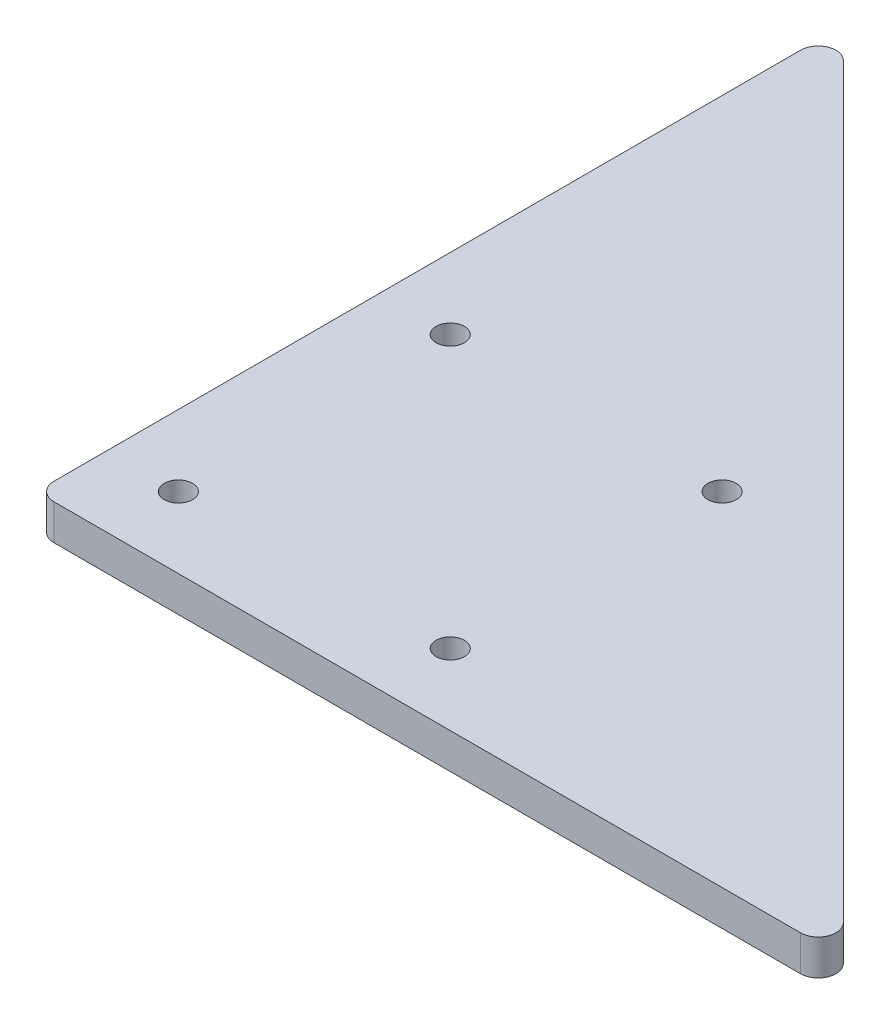
ISO-10303-21;
HEADER;
FILE_DESCRIPTION(('STEP AP214'),'2;1');
FILE_NAME('part.step','',(''),(''),'','','');
FILE_SCHEMA(('AUTOMOTIVE_DESIGN { 1 0 10303 214 1 1 1 1 }'));
ENDSEC;
DATA;
#1=APPLICATION_CONTEXT('core data for automotive mechanical design processes');
#2=APPLICATION_PROTOCOL_DEFINITION('international standard','automotive_design',2000,#1);
#3=PRODUCT_CONTEXT('',#1,'mechanical');
#4=PRODUCT('Part','Part','',(#3));
#5=PRODUCT_RELATED_PRODUCT_CATEGORY('part','',(#4));
#6=PRODUCT_DEFINITION_FORMATION('','',#4);
#7=PRODUCT_DEFINITION_CONTEXT('part definition',#1,'design');
#8=PRODUCT_DEFINITION('design','',#6,#7);
#9=PRODUCT_DEFINITION_SHAPE('','',#8);
#10=(LENGTH_UNIT() NAMED_UNIT(*) SI_UNIT(.MILLI.,.METRE.));
#11=(NAMED_UNIT(*) PLANE_ANGLE_UNIT() SI_UNIT($,.RADIAN.));
#12=(NAMED_UNIT(*) SI_UNIT($,.STERADIAN.) SOLID_ANGLE_UNIT());
#13=UNCERTAINTY_MEASURE_WITH_UNIT(LENGTH_MEASURE(1.E-05),#10,'distance_accuracy_value','');
#14=(GEOMETRIC_REPRESENTATION_CONTEXT(3) GLOBAL_UNCERTAINTY_ASSIGNED_CONTEXT((#13)) GLOBAL_UNIT_ASSIGNED_CONTEXT((#10,
#11,#12)) REPRESENTATION_CONTEXT('',''));
#15=CARTESIAN_POINT('',(0.,0.,0.));
#16=DIRECTION('',(0.,0.,1.));
#17=DIRECTION('',(1.,0.,0.));
#18=AXIS2_PLACEMENT_3D('',#15,#16,#17);
#19=CARTESIAN_POINT('',(94.2218254069472,6.,32.));
#20=DIRECTION('',(0.,-1.,0.));
#21=DIRECTION('',(0.,0.,-1.));
#22=AXIS2_PLACEMENT_3D('',#19,#20,#21);
#23=CYLINDRICAL_SURFACE('',#22,3.);
#24=CARTESIAN_POINT('',(94.2218254069472,0.,32.));
#25=DIRECTION('',(0.,1.,0.));
#26=DIRECTION('',(0.,0.,1.));
#27=AXIS2_PLACEMENT_3D('',#24,#25,#26);
#28=CIRCLE('',#27,3.);
#29=CARTESIAN_POINT('',(94.2218254069471,0.,35.));
#30=VERTEX_POINT('',#29);
#31=CARTESIAN_POINT('',(96.3431457505068,0.,29.8786796564404));
#32=VERTEX_POINT('',#31);
#33=EDGE_CURVE('E145',#30,#32,#28,.T.);
#34=ORIENTED_EDGE('',*,*,#33,.T.);
#35=DIRECTION('',(0.,-1.,0.));
#36=VECTOR('',#35,1.);
#37=CARTESIAN_POINT('',(96.3431457505068,6.,29.8786796564404));
#38=LINE('',#37,#36);
#39=CARTESIAN_POINT('',(96.3431457505068,6.,29.8786796564404));
#40=VERTEX_POINT('',#39);
#41=EDGE_CURVE('E11',#40,#32,#38,.T.);
#42=ORIENTED_EDGE('',*,*,#41,.F.);
#43=CARTESIAN_POINT('',(94.2218254069472,6.,32.));
#44=DIRECTION('',(0.,1.,0.));
#45=DIRECTION('',(0.,0.,1.));
#46=AXIS2_PLACEMENT_3D('',#43,#44,#45);
#47=CIRCLE('',#46,3.);
#48=CARTESIAN_POINT('',(94.2218254069471,6.,35.));
#49=VERTEX_POINT('',#48);
#50=EDGE_CURVE('E176',#49,#40,#47,.T.);
#51=ORIENTED_EDGE('',*,*,#50,.F.);
#52=DIRECTION('',(0.,-1.,0.));
#53=VECTOR('',#52,1.);
#54=CARTESIAN_POINT('',(94.2218254069471,6.,35.));
#55=LINE('',#54,#53);
#56=EDGE_CURVE('E144',#49,#30,#55,.T.);
#57=ORIENTED_EDGE('',*,*,#56,.T.);
#58=EDGE_LOOP('',(#34,#42,#51,#57));
#59=FACE_BOUND('',#58,.T.);
#60=ADVANCED_FACE('F38',(#59),#23,.T.);
#61=CARTESIAN_POINT('',(33.2322330470339,6.,-33.2322330470334));
#62=DIRECTION('',(-0.707106781186552,0.,0.707106781186543));
#63=DIRECTION('',(0.707106781186543,0.,0.707106781186552));
#64=AXIS2_PLACEMENT_3D('',#61,#62,#63);
#65=PLANE('',#64);
#66=DIRECTION('',(-0.707106781186543,0.,-0.707106781186552));
#67=VECTOR('',#66,1.);
#68=CARTESIAN_POINT('',(33.2322330470339,0.,-33.2322330470334));
#69=LINE('',#68,#67);
#70=CARTESIAN_POINT('',(-29.8786796564402,0.,-96.3431457505084));
#71=VERTEX_POINT('',#70);
#72=EDGE_CURVE('E149',#32,#71,#69,.T.);
#73=ORIENTED_EDGE('',*,*,#72,.T.);
#74=DIRECTION('',(0.,-1.,0.));
#75=VECTOR('',#74,1.);
#76=CARTESIAN_POINT('',(-29.8786796564402,6.,-96.3431457505084));
#77=LINE('',#76,#75);
#78=CARTESIAN_POINT('',(-29.8786796564402,6.,-96.3431457505084));
#79=VERTEX_POINT('',#78);
#80=EDGE_CURVE('E47',#79,#71,#77,.T.);
#81=ORIENTED_EDGE('',*,*,#80,.F.);
#82=DIRECTION('',(-0.707106781186543,0.,-0.707106781186552));
#83=VECTOR('',#82,1.);
#84=CARTESIAN_POINT('',(33.2322330470339,6.,-33.2322330470334));
#85=LINE('',#84,#83);
#86=EDGE_CURVE('E92',#40,#79,#85,.T.);
#87=ORIENTED_EDGE('',*,*,#86,.F.);
#88=ORIENTED_EDGE('',*,*,#41,.T.);
#89=EDGE_LOOP('',(#73,#81,#87,#88));
#90=FACE_BOUND('',#89,.T.);
#91=ADVANCED_FACE('F210',(#90),#65,.F.);
#92=CARTESIAN_POINT('',(-31.9999999999999,6.,-94.2218254069488));
#93=DIRECTION('',(0.,-1.,0.));
#94=DIRECTION('',(0.,0.,-1.));
#95=AXIS2_PLACEMENT_3D('',#92,#93,#94);
#96=CYLINDRICAL_SURFACE('',#95,3.00000000000001);
#97=CARTESIAN_POINT('',(-31.9999999999999,0.,-94.2218254069488));
#98=DIRECTION('',(0.,1.,0.));
#99=DIRECTION('',(0.,0.,1.));
#100=AXIS2_PLACEMENT_3D('',#97,#98,#99);
#101=CIRCLE('',#100,3.00000000000001);
#102=CARTESIAN_POINT('',(-34.9999999999999,0.,-94.2218254069488));
#103=VERTEX_POINT('',#102);
#104=EDGE_CURVE('E152',#71,#103,#101,.T.);
#105=ORIENTED_EDGE('',*,*,#104,.T.);
#106=DIRECTION('',(0.,-1.,0.));
#107=VECTOR('',#106,1.);
#108=CARTESIAN_POINT('',(-34.9999999999999,6.,-94.2218254069488));
#109=LINE('',#108,#107);
#110=CARTESIAN_POINT('',(-34.9999999999999,6.,-94.2218254069488));
#111=VERTEX_POINT('',#110);
#112=EDGE_CURVE('E117',#111,#103,#109,.T.);
#113=ORIENTED_EDGE('',*,*,#112,.F.);
#114=CARTESIAN_POINT('',(-31.9999999999999,6.,-94.2218254069488));
#115=DIRECTION('',(0.,1.,0.));
#116=DIRECTION('',(0.,0.,1.));
#117=AXIS2_PLACEMENT_3D('',#114,#115,#116);
#118=CIRCLE('',#117,3.00000000000001);
#119=EDGE_CURVE('E106',#79,#111,#118,.T.);
#120=ORIENTED_EDGE('',*,*,#119,.F.);
#121=ORIENTED_EDGE('',*,*,#80,.T.);
#122=EDGE_LOOP('',(#105,#113,#120,#121));
#123=FACE_BOUND('',#122,.T.);
#124=ADVANCED_FACE('F186',(#123),#96,.T.);
#125=CARTESIAN_POINT('',(-35.,6.,0.));
#126=DIRECTION('',(1.,0.,0.));
#127=DIRECTION('',(0.,0.,-1.));
#128=AXIS2_PLACEMENT_3D('',#125,#126,#127);
#129=PLANE('',#128);
#130=DIRECTION('',(0.,0.,1.));
#131=VECTOR('',#130,1.);
#132=CARTESIAN_POINT('',(-35.,0.,0.));
#133=LINE('',#132,#131);
#134=CARTESIAN_POINT('',(-35.,0.,32.));
#135=VERTEX_POINT('',#134);
#136=EDGE_CURVE('E115',#103,#135,#133,.T.);
#137=ORIENTED_EDGE('',*,*,#136,.T.);
#138=DIRECTION('',(0.,-1.,0.));
#139=VECTOR('',#138,1.);
#140=CARTESIAN_POINT('',(-35.,6.,32.));
#141=LINE('',#140,#139);
#142=CARTESIAN_POINT('',(-35.,6.,32.));
#143=VERTEX_POINT('',#142);
#144=EDGE_CURVE('E112',#143,#135,#141,.T.);
#145=ORIENTED_EDGE('',*,*,#144,.F.);
#146=DIRECTION('',(0.,0.,1.));
#147=VECTOR('',#146,1.);
#148=CARTESIAN_POINT('',(-35.,6.,0.));
#149=LINE('',#148,#147);
#150=EDGE_CURVE('E99',#111,#143,#149,.T.);
#151=ORIENTED_EDGE('',*,*,#150,.F.);
#152=ORIENTED_EDGE('',*,*,#112,.T.);
#153=EDGE_LOOP('',(#137,#145,#151,#152));
#154=FACE_BOUND('',#153,.T.);
#155=ADVANCED_FACE('F113',(#154),#129,.F.);
#156=CARTESIAN_POINT('',(-32.,6.,32.));
#157=DIRECTION('',(0.,-1.,0.));
#158=DIRECTION('',(0.,0.,-1.));
#159=AXIS2_PLACEMENT_3D('',#156,#157,#158);
#160=CYLINDRICAL_SURFACE('',#159,3.00000000000001);
#161=CARTESIAN_POINT('',(-32.,0.,32.));
#162=DIRECTION('',(0.,1.,0.));
#163=DIRECTION('',(0.,0.,1.));
#164=AXIS2_PLACEMENT_3D('',#161,#162,#163);
#165=CIRCLE('',#164,3.00000000000001);
#166=CARTESIAN_POINT('',(-32.,0.,35.));
#167=VERTEX_POINT('',#166);
#168=EDGE_CURVE('E78',#135,#167,#165,.T.);
#169=ORIENTED_EDGE('',*,*,#168,.T.);
#170=DIRECTION('',(0.,-1.,0.));
#171=VECTOR('',#170,1.);
#172=CARTESIAN_POINT('',(-32.,6.,35.));
#173=LINE('',#172,#171);
#174=CARTESIAN_POINT('',(-32.,6.,35.));
#175=VERTEX_POINT('',#174);
#176=EDGE_CURVE('E118',#175,#167,#173,.T.);
#177=ORIENTED_EDGE('',*,*,#176,.F.);
#178=CARTESIAN_POINT('',(-32.,6.,32.));
#179=DIRECTION('',(0.,1.,0.));
#180=DIRECTION('',(0.,0.,1.));
#181=AXIS2_PLACEMENT_3D('',#178,#179,#180);
#182=CIRCLE('',#181,3.00000000000001);
#183=EDGE_CURVE('E104',#143,#175,#182,.T.);
#184=ORIENTED_EDGE('',*,*,#183,.F.);
#185=ORIENTED_EDGE('',*,*,#144,.T.);
#186=EDGE_LOOP('',(#169,#177,#184,#185));
#187=FACE_BOUND('',#186,.T.);
#188=ADVANCED_FACE('F120',(#187),#160,.T.);
#189=CARTESIAN_POINT('',(22.9809703885639,6.,22.9809703885617));
#190=DIRECTION('',(0.,-1.,0.));
#191=DIRECTION('',(0.,0.,-1.));
#192=AXIS2_PLACEMENT_3D('',#189,#190,#191);
#193=CYLINDRICAL_SURFACE('',#192,2.4);
#194=CARTESIAN_POINT('',(22.9809703885639,6.,22.9809703885617));
#195=DIRECTION('',(0.,1.,0.));
#196=DIRECTION('',(0.,0.,1.));
#197=AXIS2_PLACEMENT_3D('',#194,#195,#196);
#198=CIRCLE('',#197,2.4);
#199=CARTESIAN_POINT('',(22.9809703885639,6.,25.3809703885617));
#200=VERTEX_POINT('',#199);
#201=EDGE_CURVE('E136',#200,#200,#198,.T.);
#202=ORIENTED_EDGE('',*,*,#201,.T.);
#203=EDGE_LOOP('',(#202));
#204=FACE_BOUND('',#203,.T.);
#205=CARTESIAN_POINT('',(22.9809703885639,0.,22.9809703885617));
#206=DIRECTION('',(0.,1.,0.));
#207=DIRECTION('',(0.,0.,1.));
#208=AXIS2_PLACEMENT_3D('',#205,#206,#207);
#209=CIRCLE('',#208,2.4);
#210=CARTESIAN_POINT('',(22.9809703885639,0.,25.3809703885617));
#211=VERTEX_POINT('',#210);
#212=EDGE_CURVE('E168',#211,#211,#209,.T.);
#213=ORIENTED_EDGE('',*,*,#212,.F.);
#214=EDGE_LOOP('',(#213));
#215=FACE_BOUND('',#214,.T.);
#216=ADVANCED_FACE('F221',(#204,#215),#193,.F.);
#217=CARTESIAN_POINT('',(22.9809703885628,6.,-22.9809703885639));
#218=DIRECTION('',(0.,-1.,0.));
#219=DIRECTION('',(0.,0.,-1.));
#220=AXIS2_PLACEMENT_3D('',#217,#218,#219);
#221=CYLINDRICAL_SURFACE('',#220,2.4);
#222=CARTESIAN_POINT('',(22.9809703885628,6.,-22.9809703885639));
#223=DIRECTION('',(0.,1.,0.));
#224=DIRECTION('',(0.,0.,1.));
#225=AXIS2_PLACEMENT_3D('',#222,#223,#224);
#226=CIRCLE('',#225,2.4);
#227=CARTESIAN_POINT('',(22.9809703885628,6.,-20.5809703885639));
#228=VERTEX_POINT('',#227);
#229=EDGE_CURVE('E132',#228,#228,#226,.T.);
#230=ORIENTED_EDGE('',*,*,#229,.T.);
#231=EDGE_LOOP('',(#230));
#232=FACE_BOUND('',#231,.T.);
#233=CARTESIAN_POINT('',(22.9809703885628,0.,-22.9809703885639));
#234=DIRECTION('',(0.,1.,0.));
#235=DIRECTION('',(0.,0.,1.));
#236=AXIS2_PLACEMENT_3D('',#233,#234,#235);
#237=CIRCLE('',#236,2.4);
#238=CARTESIAN_POINT('',(22.9809703885628,0.,-20.5809703885639));
#239=VERTEX_POINT('',#238);
#240=EDGE_CURVE('E164',#239,#239,#237,.T.);
#241=ORIENTED_EDGE('',*,*,#240,.F.);
#242=EDGE_LOOP('',(#241));
#243=FACE_BOUND('',#242,.T.);
#244=ADVANCED_FACE('F205',(#232,#243),#221,.F.);
#245=CARTESIAN_POINT('',(-22.9809703885628,6.,-22.9809703885628));
#246=DIRECTION('',(0.,-1.,0.));
#247=DIRECTION('',(0.,0.,-1.));
#248=AXIS2_PLACEMENT_3D('',#245,#246,#247);
#249=CYLINDRICAL_SURFACE('',#248,2.4);
#250=CARTESIAN_POINT('',(-22.9809703885628,6.,-22.9809703885628));
#251=DIRECTION('',(0.,1.,0.));
#252=DIRECTION('',(0.,0.,1.));
#253=AXIS2_PLACEMENT_3D('',#250,#251,#252);
#254=CIRCLE('',#253,2.4);
#255=CARTESIAN_POINT('',(-22.9809703885628,6.,-20.5809703885628));
#256=VERTEX_POINT('',#255);
#257=EDGE_CURVE('E126',#256,#256,#254,.T.);
#258=ORIENTED_EDGE('',*,*,#257,.T.);
#259=EDGE_LOOP('',(#258));
#260=FACE_BOUND('',#259,.T.);
#261=CARTESIAN_POINT('',(-22.9809703885628,0.,-22.9809703885628));
#262=DIRECTION('',(0.,1.,0.));
#263=DIRECTION('',(0.,0.,1.));
#264=AXIS2_PLACEMENT_3D('',#261,#262,#263);
#265=CIRCLE('',#264,2.4);
#266=CARTESIAN_POINT('',(-22.9809703885628,0.,-20.5809703885628));
#267=VERTEX_POINT('',#266);
#268=EDGE_CURVE('E160',#267,#267,#265,.T.);
#269=ORIENTED_EDGE('',*,*,#268,.F.);
#270=EDGE_LOOP('',(#269));
#271=FACE_BOUND('',#270,.T.);
#272=ADVANCED_FACE('F197',(#260,#271),#249,.F.);
#273=CARTESIAN_POINT('',(0.,6.,35.));
#274=DIRECTION('',(0.,0.,-1.));
#275=DIRECTION('',(-1.,0.,0.));
#276=AXIS2_PLACEMENT_3D('',#273,#274,#275);
#277=PLANE('',#276);
#278=DIRECTION('',(1.,0.,0.));
#279=VECTOR('',#278,1.);
#280=CARTESIAN_POINT('',(0.,0.,35.));
#281=LINE('',#280,#279);
#282=EDGE_CURVE('E84',#167,#30,#281,.T.);
#283=ORIENTED_EDGE('',*,*,#282,.T.);
#284=ORIENTED_EDGE('',*,*,#56,.F.);
#285=DIRECTION('',(1.,0.,0.));
#286=VECTOR('',#285,1.);
#287=CARTESIAN_POINT('',(0.,6.,35.));
#288=LINE('',#287,#286);
#289=EDGE_CURVE('E55',#175,#49,#288,.T.);
#290=ORIENTED_EDGE('',*,*,#289,.F.);
#291=ORIENTED_EDGE('',*,*,#176,.T.);
#292=EDGE_LOOP('',(#283,#284,#290,#291));
#293=FACE_BOUND('',#292,.T.);
#294=ADVANCED_FACE('F194',(#293),#277,.F.);
#295=CARTESIAN_POINT('',(-22.9809703885617,6.,22.9809703885628));
#296=DIRECTION('',(0.,-1.,0.));
#297=DIRECTION('',(0.,0.,-1.));
#298=AXIS2_PLACEMENT_3D('',#295,#296,#297);
#299=CYLINDRICAL_SURFACE('',#298,2.4);
#300=CARTESIAN_POINT('',(-22.9809703885617,6.,22.9809703885628));
#301=DIRECTION('',(0.,1.,0.));
#302=DIRECTION('',(0.,0.,1.));
#303=AXIS2_PLACEMENT_3D('',#300,#301,#302);
#304=CIRCLE('',#303,2.4);
#305=CARTESIAN_POINT('',(-22.9809703885617,6.,25.3809703885628));
#306=VERTEX_POINT('',#305);
#307=EDGE_CURVE('E140',#306,#306,#304,.T.);
#308=ORIENTED_EDGE('',*,*,#307,.T.);
#309=EDGE_LOOP('',(#308));
#310=FACE_BOUND('',#309,.T.);
#311=CARTESIAN_POINT('',(-22.9809703885617,0.,22.9809703885628));
#312=DIRECTION('',(0.,1.,0.));
#313=DIRECTION('',(0.,0.,1.));
#314=AXIS2_PLACEMENT_3D('',#311,#312,#313);
#315=CIRCLE('',#314,2.4);
#316=CARTESIAN_POINT('',(-22.9809703885617,0.,25.3809703885628));
#317=VERTEX_POINT('',#316);
#318=EDGE_CURVE('E172',#317,#317,#315,.T.);
#319=ORIENTED_EDGE('',*,*,#318,.F.);
#320=EDGE_LOOP('',(#319));
#321=FACE_BOUND('',#320,.T.);
#322=ADVANCED_FACE('F196',(#310,#321),#299,.F.);
#323=CARTESIAN_POINT('',(0.,6.,0.));
#324=DIRECTION('',(0.,1.,0.));
#325=DIRECTION('',(0.,0.,1.));
#326=AXIS2_PLACEMENT_3D('',#323,#324,#325);
#327=PLANE('',#326);
#328=ORIENTED_EDGE('',*,*,#50,.T.);
#329=ORIENTED_EDGE('',*,*,#86,.T.);
#330=ORIENTED_EDGE('',*,*,#119,.T.);
#331=ORIENTED_EDGE('',*,*,#150,.T.);
#332=ORIENTED_EDGE('',*,*,#183,.T.);
#333=ORIENTED_EDGE('',*,*,#289,.T.);
#334=EDGE_LOOP('',(#328,#329,#330,#331,#332,#333));
#335=FACE_BOUND('',#334,.T.);
#336=ORIENTED_EDGE('',*,*,#257,.F.);
#337=EDGE_LOOP('',(#336));
#338=FACE_BOUND('',#337,.T.);
#339=ORIENTED_EDGE('',*,*,#229,.F.);
#340=EDGE_LOOP('',(#339));
#341=FACE_BOUND('',#340,.T.);
#342=ORIENTED_EDGE('',*,*,#201,.F.);
#343=EDGE_LOOP('',(#342));
#344=FACE_BOUND('',#343,.T.);
#345=ORIENTED_EDGE('',*,*,#307,.F.);
#346=EDGE_LOOP('',(#345));
#347=FACE_BOUND('',#346,.T.);
#348=ADVANCED_FACE('F101',(#335,#338,#341,#344,#347),#327,.T.);
#349=CARTESIAN_POINT('',(0.,0.,0.));
#350=DIRECTION('',(0.,1.,0.));
#351=DIRECTION('',(0.,0.,1.));
#352=AXIS2_PLACEMENT_3D('',#349,#350,#351);
#353=PLANE('',#352);
#354=ORIENTED_EDGE('',*,*,#33,.F.);
#355=ORIENTED_EDGE('',*,*,#282,.F.);
#356=ORIENTED_EDGE('',*,*,#168,.F.);
#357=ORIENTED_EDGE('',*,*,#136,.F.);
#358=ORIENTED_EDGE('',*,*,#104,.F.);
#359=ORIENTED_EDGE('',*,*,#72,.F.);
#360=EDGE_LOOP('',(#354,#355,#356,#357,#358,#359));
#361=FACE_BOUND('',#360,.T.);
#362=ORIENTED_EDGE('',*,*,#268,.T.);
#363=EDGE_LOOP('',(#362));
#364=FACE_BOUND('',#363,.T.);
#365=ORIENTED_EDGE('',*,*,#240,.T.);
#366=EDGE_LOOP('',(#365));
#367=FACE_BOUND('',#366,.T.);
#368=ORIENTED_EDGE('',*,*,#212,.T.);
#369=EDGE_LOOP('',(#368));
#370=FACE_BOUND('',#369,.T.);
#371=ORIENTED_EDGE('',*,*,#318,.T.);
#372=EDGE_LOOP('',(#371));
#373=FACE_BOUND('',#372,.T.);
#374=ADVANCED_FACE('F189',(#361,#364,#367,#370,#373),#353,.F.);
#375=CLOSED_SHELL('',(#60,#91,#124,#155,#188,#216,#244,#272,#294,#322,#348,#374));
#376=MANIFOLD_SOLID_BREP('B2',#375);
#377=ADVANCED_BREP_SHAPE_REPRESENTATION('',(#18,#376),#14);
#378=SHAPE_DEFINITION_REPRESENTATION(#9,#377);
ENDSEC;
END-ISO-10303-21;
